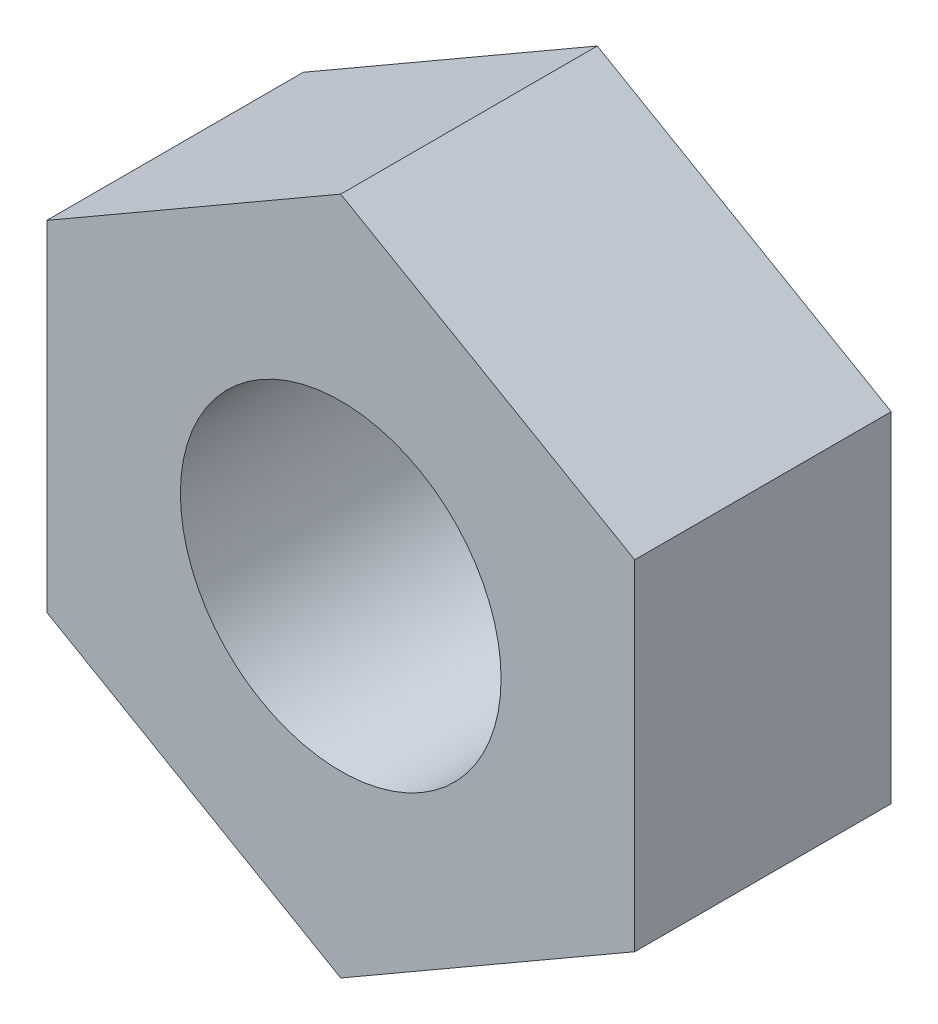
ISO-10303-21;
HEADER;
FILE_DESCRIPTION(('STEP AP214'),'2;1');
FILE_NAME('part.step','',(''),(''),'','','');
FILE_SCHEMA(('AUTOMOTIVE_DESIGN { 1 0 10303 214 1 1 1 1 }'));
ENDSEC;
DATA;
#1=APPLICATION_CONTEXT('core data for automotive mechanical design processes');
#2=APPLICATION_PROTOCOL_DEFINITION('international standard','automotive_design',2000,#1);
#3=PRODUCT_CONTEXT('',#1,'mechanical');
#4=PRODUCT('Part','Part','',(#3));
#5=PRODUCT_RELATED_PRODUCT_CATEGORY('part','',(#4));
#6=PRODUCT_DEFINITION_FORMATION('','',#4);
#7=PRODUCT_DEFINITION_CONTEXT('part definition',#1,'design');
#8=PRODUCT_DEFINITION('design','',#6,#7);
#9=PRODUCT_DEFINITION_SHAPE('','',#8);
#10=(LENGTH_UNIT() NAMED_UNIT(*) SI_UNIT(.MILLI.,.METRE.));
#11=(NAMED_UNIT(*) PLANE_ANGLE_UNIT() SI_UNIT($,.RADIAN.));
#12=(NAMED_UNIT(*) SI_UNIT($,.STERADIAN.) SOLID_ANGLE_UNIT());
#13=UNCERTAINTY_MEASURE_WITH_UNIT(LENGTH_MEASURE(1.E-05),#10,'distance_accuracy_value','');
#14=(GEOMETRIC_REPRESENTATION_CONTEXT(3) GLOBAL_UNCERTAINTY_ASSIGNED_CONTEXT((#13)) GLOBAL_UNIT_ASSIGNED_CONTEXT((#10,
#11,#12)) REPRESENTATION_CONTEXT('',''));
#15=CARTESIAN_POINT('',(0.,0.,0.));
#16=DIRECTION('',(0.,0.,1.));
#17=DIRECTION('',(1.,0.,0.));
#18=AXIS2_PLACEMENT_3D('',#15,#16,#17);
#19=CARTESIAN_POINT('',(0.,0.,2.4));
#20=DIRECTION('',(0.,0.,1.));
#21=DIRECTION('',(1.,0.,0.));
#22=AXIS2_PLACEMENT_3D('',#19,#20,#21);
#23=PLANE('',#22);
#24=DIRECTION('',(0.866025403784439,-0.5,0.));
#25=VECTOR('',#24,1.);
#26=CARTESIAN_POINT('',(-2.75,-1.58771324027147,2.4));
#27=LINE('',#26,#25);
#28=CARTESIAN_POINT('',(-2.75,-1.58771324027147,2.4));
#29=VERTEX_POINT('',#28);
#30=CARTESIAN_POINT('',(0.,-3.17542648054294,2.4));
#31=VERTEX_POINT('',#30);
#32=EDGE_CURVE('E129',#29,#31,#27,.T.);
#33=ORIENTED_EDGE('',*,*,#32,.T.);
#34=DIRECTION('',(0.866025403784439,0.5,0.));
#35=VECTOR('',#34,1.);
#36=CARTESIAN_POINT('',(0.,-3.17542648054294,2.4));
#37=LINE('',#36,#35);
#38=CARTESIAN_POINT('',(2.75,-1.58771324027147,2.4));
#39=VERTEX_POINT('',#38);
#40=EDGE_CURVE('E87',#31,#39,#37,.T.);
#41=ORIENTED_EDGE('',*,*,#40,.T.);
#42=DIRECTION('',(0.,1.,0.));
#43=VECTOR('',#42,1.);
#44=CARTESIAN_POINT('',(2.75,-1.58771324027147,2.4));
#45=LINE('',#44,#43);
#46=CARTESIAN_POINT('',(2.75,1.58771324027147,2.4));
#47=VERTEX_POINT('',#46);
#48=EDGE_CURVE('E100',#39,#47,#45,.T.);
#49=ORIENTED_EDGE('',*,*,#48,.T.);
#50=DIRECTION('',(-0.866025403784439,0.5,0.));
#51=VECTOR('',#50,1.);
#52=CARTESIAN_POINT('',(2.75,1.58771324027147,2.4));
#53=LINE('',#52,#51);
#54=CARTESIAN_POINT('',(0.,3.17542648054294,2.4));
#55=VERTEX_POINT('',#54);
#56=EDGE_CURVE('E94',#47,#55,#53,.T.);
#57=ORIENTED_EDGE('',*,*,#56,.T.);
#58=DIRECTION('',(-0.866025403784439,-0.5,0.));
#59=VECTOR('',#58,1.);
#60=CARTESIAN_POINT('',(0.,3.17542648054294,2.4));
#61=LINE('',#60,#59);
#62=CARTESIAN_POINT('',(-2.75,1.58771324027147,2.4));
#63=VERTEX_POINT('',#62);
#64=EDGE_CURVE('E98',#55,#63,#61,.T.);
#65=ORIENTED_EDGE('',*,*,#64,.T.);
#66=DIRECTION('',(0.,-1.,0.));
#67=VECTOR('',#66,1.);
#68=CARTESIAN_POINT('',(-2.75,1.58771324027147,2.4));
#69=LINE('',#68,#67);
#70=EDGE_CURVE('E50',#63,#29,#69,.T.);
#71=ORIENTED_EDGE('',*,*,#70,.T.);
#72=EDGE_LOOP('',(#33,#41,#49,#57,#65,#71));
#73=FACE_BOUND('',#72,.T.);
#74=CARTESIAN_POINT('',(0.,0.,2.4));
#75=DIRECTION('',(0.,0.,1.));
#76=DIRECTION('',(1.,0.,0.));
#77=AXIS2_PLACEMENT_3D('',#74,#75,#76);
#78=CIRCLE('',#77,1.5);
#79=CARTESIAN_POINT('',(1.5,0.,2.4));
#80=VERTEX_POINT('',#79);
#81=EDGE_CURVE('E122',#80,#80,#78,.T.);
#82=ORIENTED_EDGE('',*,*,#81,.F.);
#83=EDGE_LOOP('',(#82));
#84=FACE_BOUND('',#83,.T.);
#85=ADVANCED_FACE('F33',(#73,#84),#23,.T.);
#86=CARTESIAN_POINT('',(0.,0.,0.));
#87=DIRECTION('',(0.,0.,1.));
#88=DIRECTION('',(1.,0.,0.));
#89=AXIS2_PLACEMENT_3D('',#86,#87,#88);
#90=PLANE('',#89);
#91=DIRECTION('',(0.866025403784439,-0.5,0.));
#92=VECTOR('',#91,1.);
#93=CARTESIAN_POINT('',(-2.75,-1.58771324027147,0.));
#94=LINE('',#93,#92);
#95=CARTESIAN_POINT('',(-2.75,-1.58771324027147,0.));
#96=VERTEX_POINT('',#95);
#97=CARTESIAN_POINT('',(0.,-3.17542648054294,0.));
#98=VERTEX_POINT('',#97);
#99=EDGE_CURVE('E118',#96,#98,#94,.T.);
#100=ORIENTED_EDGE('',*,*,#99,.F.);
#101=DIRECTION('',(0.,-1.,0.));
#102=VECTOR('',#101,1.);
#103=CARTESIAN_POINT('',(-2.75,1.58771324027147,0.));
#104=LINE('',#103,#102);
#105=CARTESIAN_POINT('',(-2.75,1.58771324027147,0.));
#106=VERTEX_POINT('',#105);
#107=EDGE_CURVE('E79',#106,#96,#104,.T.);
#108=ORIENTED_EDGE('',*,*,#107,.F.);
#109=DIRECTION('',(-0.866025403784439,-0.5,0.));
#110=VECTOR('',#109,1.);
#111=CARTESIAN_POINT('',(0.,3.17542648054294,0.));
#112=LINE('',#111,#110);
#113=CARTESIAN_POINT('',(0.,3.17542648054294,0.));
#114=VERTEX_POINT('',#113);
#115=EDGE_CURVE('E73',#114,#106,#112,.T.);
#116=ORIENTED_EDGE('',*,*,#115,.F.);
#117=DIRECTION('',(-0.866025403784439,0.5,0.));
#118=VECTOR('',#117,1.);
#119=CARTESIAN_POINT('',(2.75,1.58771324027147,0.));
#120=LINE('',#119,#118);
#121=CARTESIAN_POINT('',(2.75,1.58771324027147,0.));
#122=VERTEX_POINT('',#121);
#123=EDGE_CURVE('E108',#122,#114,#120,.T.);
#124=ORIENTED_EDGE('',*,*,#123,.F.);
#125=DIRECTION('',(0.,1.,0.));
#126=VECTOR('',#125,1.);
#127=CARTESIAN_POINT('',(2.75,-1.58771324027147,0.));
#128=LINE('',#127,#126);
#129=CARTESIAN_POINT('',(2.75,-1.58771324027147,0.));
#130=VERTEX_POINT('',#129);
#131=EDGE_CURVE('E124',#130,#122,#128,.T.);
#132=ORIENTED_EDGE('',*,*,#131,.F.);
#133=DIRECTION('',(0.866025403784439,0.5,0.));
#134=VECTOR('',#133,1.);
#135=CARTESIAN_POINT('',(0.,-3.17542648054294,0.));
#136=LINE('',#135,#134);
#137=EDGE_CURVE('E121',#98,#130,#136,.T.);
#138=ORIENTED_EDGE('',*,*,#137,.F.);
#139=EDGE_LOOP('',(#100,#108,#116,#124,#132,#138));
#140=FACE_BOUND('',#139,.T.);
#141=CARTESIAN_POINT('',(0.,0.,0.));
#142=DIRECTION('',(0.,0.,1.));
#143=DIRECTION('',(1.,0.,0.));
#144=AXIS2_PLACEMENT_3D('',#141,#142,#143);
#145=CIRCLE('',#144,1.5);
#146=CARTESIAN_POINT('',(1.5,0.,0.));
#147=VERTEX_POINT('',#146);
#148=EDGE_CURVE('E222',#147,#147,#145,.T.);
#149=ORIENTED_EDGE('',*,*,#148,.T.);
#150=EDGE_LOOP('',(#149));
#151=FACE_BOUND('',#150,.T.);
#152=ADVANCED_FACE('F138',(#140,#151),#90,.F.);
#153=CARTESIAN_POINT('',(-2.75,-1.58771324027147,2.4));
#154=DIRECTION('',(0.5,0.866025403784439,0.));
#155=DIRECTION('',(-0.866025403784439,0.5,0.));
#156=AXIS2_PLACEMENT_3D('',#153,#154,#155);
#157=PLANE('',#156);
#158=ORIENTED_EDGE('',*,*,#99,.T.);
#159=DIRECTION('',(0.,0.,-1.));
#160=VECTOR('',#159,1.);
#161=CARTESIAN_POINT('',(0.,-3.17542648054294,2.4));
#162=LINE('',#161,#160);
#163=EDGE_CURVE('E11',#31,#98,#162,.T.);
#164=ORIENTED_EDGE('',*,*,#163,.F.);
#165=ORIENTED_EDGE('',*,*,#32,.F.);
#166=DIRECTION('',(0.,0.,-1.));
#167=VECTOR('',#166,1.);
#168=CARTESIAN_POINT('',(-2.75,-1.58771324027147,2.4));
#169=LINE('',#168,#167);
#170=EDGE_CURVE('E114',#29,#96,#169,.T.);
#171=ORIENTED_EDGE('',*,*,#170,.T.);
#172=EDGE_LOOP('',(#158,#164,#165,#171));
#173=FACE_BOUND('',#172,.T.);
#174=ADVANCED_FACE('F35',(#173),#157,.F.);
#175=CARTESIAN_POINT('',(0.,-3.17542648054294,2.4));
#176=DIRECTION('',(-0.5,0.866025403784439,0.));
#177=DIRECTION('',(-0.866025403784439,-0.5,0.));
#178=AXIS2_PLACEMENT_3D('',#175,#176,#177);
#179=PLANE('',#178);
#180=ORIENTED_EDGE('',*,*,#137,.T.);
#181=DIRECTION('',(0.,0.,-1.));
#182=VECTOR('',#181,1.);
#183=CARTESIAN_POINT('',(2.75,-1.58771324027147,2.4));
#184=LINE('',#183,#182);
#185=EDGE_CURVE('E42',#39,#130,#184,.T.);
#186=ORIENTED_EDGE('',*,*,#185,.F.);
#187=ORIENTED_EDGE('',*,*,#40,.F.);
#188=ORIENTED_EDGE('',*,*,#163,.T.);
#189=EDGE_LOOP('',(#180,#186,#187,#188));
#190=FACE_BOUND('',#189,.T.);
#191=ADVANCED_FACE('F163',(#190),#179,.F.);
#192=CARTESIAN_POINT('',(2.75,-1.58771324027147,2.4));
#193=DIRECTION('',(-1.,0.,0.));
#194=DIRECTION('',(0.,0.,1.));
#195=AXIS2_PLACEMENT_3D('',#192,#193,#194);
#196=PLANE('',#195);
#197=ORIENTED_EDGE('',*,*,#131,.T.);
#198=DIRECTION('',(0.,0.,-1.));
#199=VECTOR('',#198,1.);
#200=CARTESIAN_POINT('',(2.75,1.58771324027147,2.4));
#201=LINE('',#200,#199);
#202=EDGE_CURVE('E109',#47,#122,#201,.T.);
#203=ORIENTED_EDGE('',*,*,#202,.F.);
#204=ORIENTED_EDGE('',*,*,#48,.F.);
#205=ORIENTED_EDGE('',*,*,#185,.T.);
#206=EDGE_LOOP('',(#197,#203,#204,#205));
#207=FACE_BOUND('',#206,.T.);
#208=ADVANCED_FACE('F135',(#207),#196,.F.);
#209=CARTESIAN_POINT('',(2.75,1.58771324027147,2.4));
#210=DIRECTION('',(-0.5,-0.866025403784439,0.));
#211=DIRECTION('',(0.866025403784439,-0.5,0.));
#212=AXIS2_PLACEMENT_3D('',#209,#210,#211);
#213=PLANE('',#212);
#214=ORIENTED_EDGE('',*,*,#123,.T.);
#215=DIRECTION('',(0.,0.,-1.));
#216=VECTOR('',#215,1.);
#217=CARTESIAN_POINT('',(0.,3.17542648054294,2.4));
#218=LINE('',#217,#216);
#219=EDGE_CURVE('E105',#55,#114,#218,.T.);
#220=ORIENTED_EDGE('',*,*,#219,.F.);
#221=ORIENTED_EDGE('',*,*,#56,.F.);
#222=ORIENTED_EDGE('',*,*,#202,.T.);
#223=EDGE_LOOP('',(#214,#220,#221,#222));
#224=FACE_BOUND('',#223,.T.);
#225=ADVANCED_FACE('F106',(#224),#213,.F.);
#226=CARTESIAN_POINT('',(0.,3.17542648054294,2.4));
#227=DIRECTION('',(0.5,-0.866025403784439,0.));
#228=DIRECTION('',(0.866025403784439,0.5,0.));
#229=AXIS2_PLACEMENT_3D('',#226,#227,#228);
#230=PLANE('',#229);
#231=ORIENTED_EDGE('',*,*,#115,.T.);
#232=DIRECTION('',(0.,0.,-1.));
#233=VECTOR('',#232,1.);
#234=CARTESIAN_POINT('',(-2.75,1.58771324027147,2.4));
#235=LINE('',#234,#233);
#236=EDGE_CURVE('E110',#63,#106,#235,.T.);
#237=ORIENTED_EDGE('',*,*,#236,.F.);
#238=ORIENTED_EDGE('',*,*,#64,.F.);
#239=ORIENTED_EDGE('',*,*,#219,.T.);
#240=EDGE_LOOP('',(#231,#237,#238,#239));
#241=FACE_BOUND('',#240,.T.);
#242=ADVANCED_FACE('F112',(#241),#230,.F.);
#243=CARTESIAN_POINT('',(-2.75,1.58771324027147,2.4));
#244=DIRECTION('',(1.,0.,0.));
#245=DIRECTION('',(0.,0.,-1.));
#246=AXIS2_PLACEMENT_3D('',#243,#244,#245);
#247=PLANE('',#246);
#248=ORIENTED_EDGE('',*,*,#107,.T.);
#249=ORIENTED_EDGE('',*,*,#170,.F.);
#250=ORIENTED_EDGE('',*,*,#70,.F.);
#251=ORIENTED_EDGE('',*,*,#236,.T.);
#252=EDGE_LOOP('',(#248,#249,#250,#251));
#253=FACE_BOUND('',#252,.T.);
#254=ADVANCED_FACE('F143',(#253),#247,.F.);
#255=CARTESIAN_POINT('',(0.,0.,2.4));
#256=DIRECTION('',(0.,0.,-1.));
#257=DIRECTION('',(-1.,0.,0.));
#258=AXIS2_PLACEMENT_3D('',#255,#256,#257);
#259=CYLINDRICAL_SURFACE('',#258,1.5);
#260=ORIENTED_EDGE('',*,*,#81,.T.);
#261=EDGE_LOOP('',(#260));
#262=FACE_BOUND('',#261,.T.);
#263=ORIENTED_EDGE('',*,*,#148,.F.);
#264=EDGE_LOOP('',(#263));
#265=FACE_BOUND('',#264,.T.);
#266=ADVANCED_FACE('F145',(#262,#265),#259,.F.);
#267=CLOSED_SHELL('',(#85,#152,#174,#191,#208,#225,#242,#254,#266));
#268=MANIFOLD_SOLID_BREP('B2',#267);
#269=ADVANCED_BREP_SHAPE_REPRESENTATION('',(#18,#268),#14);
#270=SHAPE_DEFINITION_REPRESENTATION(#9,#269);
ENDSEC;
END-ISO-10303-21;
